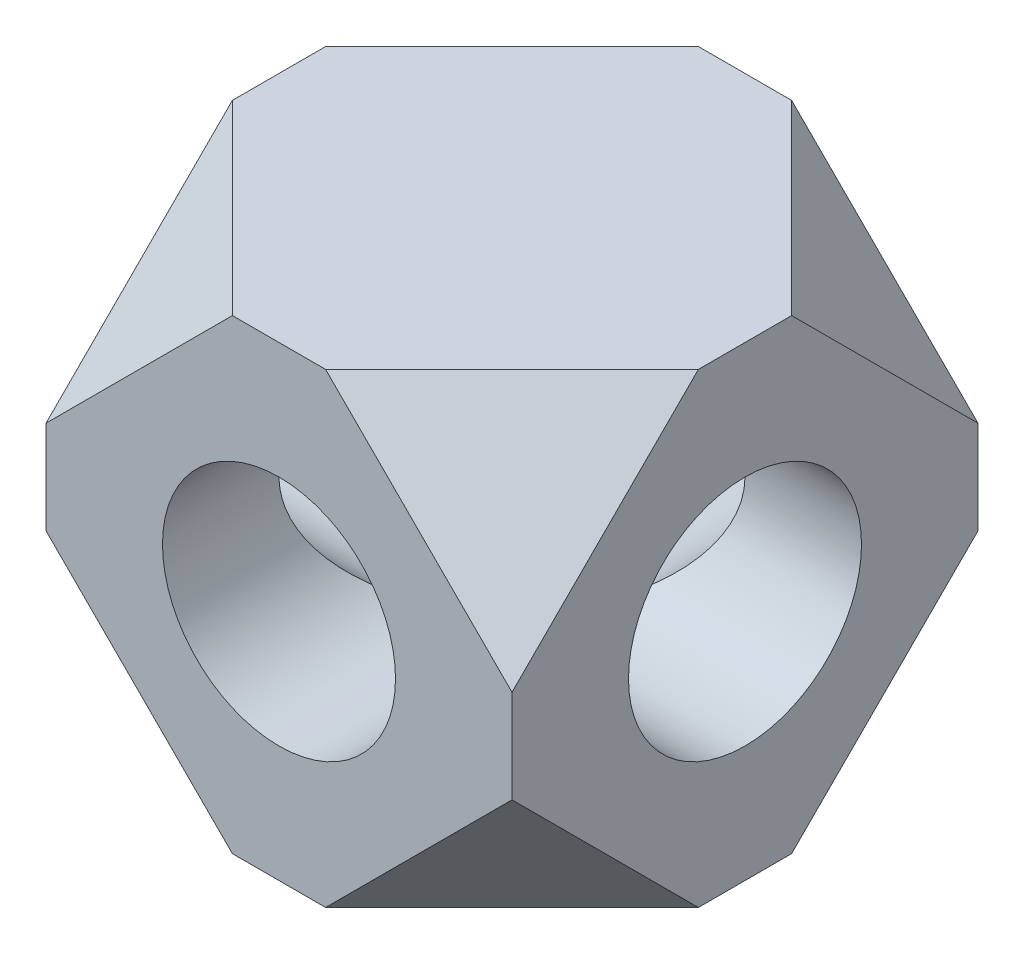
ISO-10303-21;
HEADER;
FILE_DESCRIPTION(('STEP AP214'),'2;1');
FILE_NAME('part.step','',(''),(''),'','','');
FILE_SCHEMA(('AUTOMOTIVE_DESIGN { 1 0 10303 214 1 1 1 1 }'));
ENDSEC;
DATA;
#1=APPLICATION_CONTEXT('core data for automotive mechanical design processes');
#2=APPLICATION_PROTOCOL_DEFINITION('international standard','automotive_design',2000,#1);
#3=PRODUCT_CONTEXT('',#1,'mechanical');
#4=PRODUCT('Part','Part','',(#3));
#5=PRODUCT_RELATED_PRODUCT_CATEGORY('part','',(#4));
#6=PRODUCT_DEFINITION_FORMATION('','',#4);
#7=PRODUCT_DEFINITION_CONTEXT('part definition',#1,'design');
#8=PRODUCT_DEFINITION('design','',#6,#7);
#9=PRODUCT_DEFINITION_SHAPE('','',#8);
#10=(LENGTH_UNIT() NAMED_UNIT(*) SI_UNIT(.MILLI.,.METRE.));
#11=(NAMED_UNIT(*) PLANE_ANGLE_UNIT() SI_UNIT($,.RADIAN.));
#12=(NAMED_UNIT(*) SI_UNIT($,.STERADIAN.) SOLID_ANGLE_UNIT());
#13=UNCERTAINTY_MEASURE_WITH_UNIT(LENGTH_MEASURE(1.E-05),#10,'distance_accuracy_value','');
#14=(GEOMETRIC_REPRESENTATION_CONTEXT(3) GLOBAL_UNCERTAINTY_ASSIGNED_CONTEXT((#13)) GLOBAL_UNIT_ASSIGNED_CONTEXT((#10,
#11,#12)) REPRESENTATION_CONTEXT('',''));
#15=CARTESIAN_POINT('',(0.,0.,0.));
#16=DIRECTION('',(0.,0.,1.));
#17=DIRECTION('',(1.,0.,0.));
#18=AXIS2_PLACEMENT_3D('',#15,#16,#17);
#19=CARTESIAN_POINT('',(9.52499999999997,9.52500000000031,9.52500000000006));
#20=DIRECTION('',(0.999999999999997,0.,0.));
#21=DIRECTION('',(0.,1.,0.));
#22=AXIS2_PLACEMENT_3D('',#19,#20,#21);
#23=PLANE('',#22);
#24=CARTESIAN_POINT('',(9.525,2.35922392732846E-13,0.));
#25=DIRECTION('',(0.999999999999997,0.,0.));
#26=DIRECTION('',(0.,0.,-1.));
#27=AXIS2_PLACEMENT_3D('',#24,#25,#26);
#28=CIRCLE('',#27,4.7625);
#29=CARTESIAN_POINT('',(9.52499999999998,2.31560257080154E-13,-4.76250000000001));
#30=VERTEX_POINT('',#29);
#31=EDGE_CURVE('E241',#30,#30,#28,.T.);
#32=ORIENTED_EDGE('',*,*,#31,.F.);
#33=EDGE_LOOP('',(#32));
#34=FACE_BOUND('',#33,.T.);
#35=DIRECTION('',(0.,-1.,0.));
#36=VECTOR('',#35,1.);
#37=CARTESIAN_POINT('',(9.52499999999997,9.52500000000031,9.52500000000006));
#38=LINE('',#37,#36);
#39=CARTESIAN_POINT('',(9.52499999999997,1.90500000000036,9.52500000000006));
#40=VERTEX_POINT('',#39);
#41=CARTESIAN_POINT('',(9.52500000000001,-1.90499999999991,9.525));
#42=VERTEX_POINT('',#41);
#43=EDGE_CURVE('E140',#40,#42,#38,.T.);
#44=ORIENTED_EDGE('',*,*,#43,.T.);
#45=DIRECTION('',(0.,-0.707106781186548,-0.707106781186547));
#46=VECTOR('',#45,1.);
#47=CARTESIAN_POINT('',(9.52499999999994,3.81000000000023,15.2400000000002));
#48=LINE('',#47,#46);
#49=CARTESIAN_POINT('',(9.52500000000004,-9.5249999999997,1.90500000000015));
#50=VERTEX_POINT('',#49);
#51=EDGE_CURVE('E139',#42,#50,#48,.T.);
#52=ORIENTED_EDGE('',*,*,#51,.T.);
#53=DIRECTION('',(0.,0.,-1.));
#54=VECTOR('',#53,1.);
#55=CARTESIAN_POINT('',(9.52500000000006,-9.52499999999981,9.52500000000003));
#56=LINE('',#55,#54);
#57=CARTESIAN_POINT('',(9.52500000000004,-9.52499999999976,-1.90500000000011));
#58=VERTEX_POINT('',#57);
#59=EDGE_CURVE('E128',#50,#58,#56,.T.);
#60=ORIENTED_EDGE('',*,*,#59,.T.);
#61=DIRECTION('',(0.,0.707106781186551,-0.707106781186544));
#62=VECTOR('',#61,1.);
#63=CARTESIAN_POINT('',(9.52499999999996,-5.71499999999974,-5.71500000000013));
#64=LINE('',#63,#62);
#65=CARTESIAN_POINT('',(9.52499999999999,-1.90499999999983,-9.52500000000001));
#66=VERTEX_POINT('',#65);
#67=EDGE_CURVE('E154',#58,#66,#64,.T.);
#68=ORIENTED_EDGE('',*,*,#67,.T.);
#69=DIRECTION('',(0.,-1.,0.));
#70=VECTOR('',#69,1.);
#71=CARTESIAN_POINT('',(9.52499999999997,9.52500000000021,-9.525));
#72=LINE('',#71,#70);
#73=CARTESIAN_POINT('',(9.525,1.90500000000012,-9.52500000000005));
#74=VERTEX_POINT('',#73);
#75=EDGE_CURVE('E221',#74,#66,#72,.T.);
#76=ORIENTED_EDGE('',*,*,#75,.F.);
#77=DIRECTION('',(0.,0.707106781186547,0.707106781186548));
#78=VECTOR('',#77,1.);
#79=CARTESIAN_POINT('',(9.525,15.2400000000003,3.81000000000009));
#80=LINE('',#79,#78);
#81=CARTESIAN_POINT('',(9.52499999999995,9.52500000000032,-1.90499999999994));
#82=VERTEX_POINT('',#81);
#83=EDGE_CURVE('E181',#74,#82,#80,.T.);
#84=ORIENTED_EDGE('',*,*,#83,.T.);
#85=DIRECTION('',(0.,0.,-1.));
#86=VECTOR('',#85,1.);
#87=CARTESIAN_POINT('',(9.52499999999997,9.52500000000031,9.52500000000006));
#88=LINE('',#87,#86);
#89=CARTESIAN_POINT('',(9.52499999999995,9.52500000000031,1.90500000000004));
#90=VERTEX_POINT('',#89);
#91=EDGE_CURVE('E136',#90,#82,#88,.T.);
#92=ORIENTED_EDGE('',*,*,#91,.F.);
#93=DIRECTION('',(0.,-0.707106781186544,0.707106781186551));
#94=VECTOR('',#93,1.);
#95=CARTESIAN_POINT('',(9.52499999999997,5.71500000000029,5.71500000000008));
#96=LINE('',#95,#94);
#97=EDGE_CURVE('E187',#90,#40,#96,.T.);
#98=ORIENTED_EDGE('',*,*,#97,.T.);
#99=EDGE_LOOP('',(#44,#52,#60,#68,#76,#84,#92,#98));
#100=FACE_BOUND('',#99,.T.);
#101=ADVANCED_FACE('F37',(#34,#100),#23,.T.);
#102=CARTESIAN_POINT('',(-9.52499999999987,-9.52499999999976,9.525));
#103=DIRECTION('',(-0.999999999999997,0.,0.));
#104=DIRECTION('',(0.,-1.,0.));
#105=AXIS2_PLACEMENT_3D('',#102,#103,#104);
#106=PLANE('',#105);
#107=CARTESIAN_POINT('',(-9.52499999999991,2.08166817117217E-13,0.));
#108=DIRECTION('',(0.999999999999997,0.,0.));
#109=DIRECTION('',(0.,0.,-1.));
#110=AXIS2_PLACEMENT_3D('',#107,#108,#109);
#111=CIRCLE('',#110,4.7625);
#112=CARTESIAN_POINT('',(-9.52499999999992,2.03804681464526E-13,-4.76250000000006));
#113=VERTEX_POINT('',#112);
#114=EDGE_CURVE('E238',#113,#113,#111,.T.);
#115=ORIENTED_EDGE('',*,*,#114,.T.);
#116=EDGE_LOOP('',(#115));
#117=FACE_BOUND('',#116,.T.);
#118=DIRECTION('',(0.,0.,-1.));
#119=VECTOR('',#118,1.);
#120=CARTESIAN_POINT('',(-9.52499999999987,-9.52499999999976,9.525));
#121=LINE('',#120,#119);
#122=CARTESIAN_POINT('',(-9.52499999999988,-9.52499999999976,1.90500000000002));
#123=VERTEX_POINT('',#122);
#124=CARTESIAN_POINT('',(-9.52499999999989,-9.52499999999974,-1.90500000000005));
#125=VERTEX_POINT('',#124);
#126=EDGE_CURVE('E135',#123,#125,#121,.T.);
#127=ORIENTED_EDGE('',*,*,#126,.F.);
#128=DIRECTION('',(0.,0.707106781186547,0.707106781186548));
#129=VECTOR('',#128,1.);
#130=CARTESIAN_POINT('',(-9.52499999999985,-5.71499999999978,5.71500000000002));
#131=LINE('',#130,#129);
#132=CARTESIAN_POINT('',(-9.52499999999989,-1.90499999999977,9.525));
#133=VERTEX_POINT('',#132);
#134=EDGE_CURVE('E151',#123,#133,#131,.T.);
#135=ORIENTED_EDGE('',*,*,#134,.T.);
#136=DIRECTION('',(0.,1.,0.));
#137=VECTOR('',#136,1.);
#138=CARTESIAN_POINT('',(-9.52499999999987,-9.52499999999976,9.525));
#139=LINE('',#138,#137);
#140=CARTESIAN_POINT('',(-9.52499999999986,1.90500000000025,9.52500000000001));
#141=VERTEX_POINT('',#140);
#142=EDGE_CURVE('E220',#133,#141,#139,.T.);
#143=ORIENTED_EDGE('',*,*,#142,.T.);
#144=DIRECTION('',(0.,0.707106781186551,-0.707106781186544));
#145=VECTOR('',#144,1.);
#146=CARTESIAN_POINT('',(-9.52499999999986,-3.8099999999998,15.24));
#147=LINE('',#146,#145);
#148=CARTESIAN_POINT('',(-9.52499999999997,9.52500000000027,1.90499999999989));
#149=VERTEX_POINT('',#148);
#150=EDGE_CURVE('E195',#141,#149,#147,.T.);
#151=ORIENTED_EDGE('',*,*,#150,.T.);
#152=DIRECTION('',(0.,0.,-1.));
#153=VECTOR('',#152,1.);
#154=CARTESIAN_POINT('',(-9.52499999999986,9.52500000000026,9.52500000000001));
#155=LINE('',#154,#153);
#156=CARTESIAN_POINT('',(-9.52499999999988,9.52500000000026,-1.90500000000009));
#157=VERTEX_POINT('',#156);
#158=EDGE_CURVE('E212',#149,#157,#155,.T.);
#159=ORIENTED_EDGE('',*,*,#158,.T.);
#160=DIRECTION('',(0.,-0.707106781186548,-0.707106781186547));
#161=VECTOR('',#160,1.);
#162=CARTESIAN_POINT('',(-9.52499999999979,5.71500000000033,-5.71500000000013));
#163=LINE('',#162,#161);
#164=CARTESIAN_POINT('',(-9.52499999999986,1.90500000000042,-9.52500000000003));
#165=VERTEX_POINT('',#164);
#166=EDGE_CURVE('E170',#157,#165,#163,.T.);
#167=ORIENTED_EDGE('',*,*,#166,.T.);
#168=DIRECTION('',(0.,1.,0.));
#169=VECTOR('',#168,1.);
#170=CARTESIAN_POINT('',(-9.5249999999999,-9.52499999999977,-9.52500000000005));
#171=LINE('',#170,#169);
#172=CARTESIAN_POINT('',(-9.52499999999991,-1.90499999999976,-9.52500000000005));
#173=VERTEX_POINT('',#172);
#174=EDGE_CURVE('E226',#173,#165,#171,.T.);
#175=ORIENTED_EDGE('',*,*,#174,.F.);
#176=DIRECTION('',(0.,-0.707106781186544,0.707106781186551));
#177=VECTOR('',#176,1.);
#178=CARTESIAN_POINT('',(-9.52499999999987,-15.2399999999998,3.81000000000001));
#179=LINE('',#178,#177);
#180=EDGE_CURVE('E164',#173,#125,#179,.T.);
#181=ORIENTED_EDGE('',*,*,#180,.T.);
#182=EDGE_LOOP('',(#127,#135,#143,#151,#159,#167,#175,#181));
#183=FACE_BOUND('',#182,.T.);
#184=ADVANCED_FACE('F39',(#117,#183),#106,.T.);
#185=CARTESIAN_POINT('',(-9.5249999999999,-9.52499999999977,-9.52500000000005));
#186=DIRECTION('',(0.,0.,-1.));
#187=DIRECTION('',(-0.999999999999997,0.,0.));
#188=AXIS2_PLACEMENT_3D('',#185,#186,#187);
#189=PLANE('',#188);
#190=CARTESIAN_POINT('',(0.,1.2490009027033E-13,-9.52500000000004));
#191=DIRECTION('',(0.,0.,1.));
#192=DIRECTION('',(0.999999999999997,0.,0.));
#193=AXIS2_PLACEMENT_3D('',#190,#191,#192);
#194=CIRCLE('',#193,4.7625);
#195=CARTESIAN_POINT('',(4.76250000000003,1.10624009952431E-13,-9.52500000000003));
#196=VERTEX_POINT('',#195);
#197=EDGE_CURVE('E235',#196,#196,#194,.T.);
#198=ORIENTED_EDGE('',*,*,#197,.T.);
#199=EDGE_LOOP('',(#198));
#200=FACE_BOUND('',#199,.T.);
#201=ORIENTED_EDGE('',*,*,#75,.T.);
#202=DIRECTION('',(-0.707106781186546,-0.70710678118655,0.));
#203=VECTOR('',#202,1.);
#204=CARTESIAN_POINT('',(-3.80999999999992,-15.2399999999997,-9.52500000000005));
#205=LINE('',#204,#203);
#206=CARTESIAN_POINT('',(1.90500000000009,-9.52499999999971,-9.52500000000004));
#207=VERTEX_POINT('',#206);
#208=EDGE_CURVE('E156',#66,#207,#205,.T.);
#209=ORIENTED_EDGE('',*,*,#208,.T.);
#210=DIRECTION('',(0.999999999999997,0.,0.));
#211=VECTOR('',#210,1.);
#212=CARTESIAN_POINT('',(-9.5249999999999,-9.52499999999977,-9.52500000000005));
#213=LINE('',#212,#211);
#214=CARTESIAN_POINT('',(-1.90499999999997,-9.52499999999976,-9.52500000000004));
#215=VERTEX_POINT('',#214);
#216=EDGE_CURVE('E218',#215,#207,#213,.T.);
#217=ORIENTED_EDGE('',*,*,#216,.F.);
#218=DIRECTION('',(-0.707106781186548,0.707106781186547,0.));
#219=VECTOR('',#218,1.);
#220=CARTESIAN_POINT('',(-5.7149999999999,-5.71499999999977,-9.52500000000006));
#221=LINE('',#220,#219);
#222=EDGE_CURVE('E162',#215,#173,#221,.T.);
#223=ORIENTED_EDGE('',*,*,#222,.T.);
#224=ORIENTED_EDGE('',*,*,#174,.T.);
#225=DIRECTION('',(0.70710678118655,0.707106781186545,0.));
#226=VECTOR('',#225,1.);
#227=CARTESIAN_POINT('',(-15.2399999999999,-3.8099999999997,-9.52500000000004));
#228=LINE('',#227,#226);
#229=CARTESIAN_POINT('',(-1.90499999999989,9.5250000000003,-9.52500000000003));
#230=VERTEX_POINT('',#229);
#231=EDGE_CURVE('E173',#165,#230,#228,.T.);
#232=ORIENTED_EDGE('',*,*,#231,.T.);
#233=DIRECTION('',(-0.999999999999997,0.,0.));
#234=VECTOR('',#233,1.);
#235=CARTESIAN_POINT('',(9.52499999999997,9.52500000000021,-9.525));
#236=LINE('',#235,#234);
#237=CARTESIAN_POINT('',(1.9049999999999,9.52500000000027,-9.52500000000002));
#238=VERTEX_POINT('',#237);
#239=EDGE_CURVE('E224',#238,#230,#236,.T.);
#240=ORIENTED_EDGE('',*,*,#239,.F.);
#241=DIRECTION('',(0.707106781186547,-0.707106781186548,0.));
#242=VECTOR('',#241,1.);
#243=CARTESIAN_POINT('',(5.71500000000002,5.71500000000011,-9.52500000000009));
#244=LINE('',#243,#242);
#245=EDGE_CURVE('E179',#238,#74,#244,.T.);
#246=ORIENTED_EDGE('',*,*,#245,.T.);
#247=EDGE_LOOP('',(#201,#209,#217,#223,#224,#232,#240,#246));
#248=FACE_BOUND('',#247,.T.);
#249=ADVANCED_FACE('F272',(#200,#248),#189,.T.);
#250=CARTESIAN_POINT('',(0.,2.08166817117217E-13,9.525));
#251=DIRECTION('',(0.,0.,-1.));
#252=DIRECTION('',(-0.999999999999997,0.,0.));
#253=AXIS2_PLACEMENT_3D('',#250,#251,#252);
#254=CYLINDRICAL_SURFACE('',#253,4.7625);
#255=CARTESIAN_POINT('',(0.,2.08166817117217E-13,0.));
#256=DIRECTION('',(0.707106781186544,0.,-0.707106781186548));
#257=DIRECTION('',(-0.707106781186546,0.,-0.707106781186551));
#258=AXIS2_PLACEMENT_3D('',#255,#256,#257);
#259=ELLIPSE('',#258,6.73519209080187,4.7625);
#260=CARTESIAN_POINT('',(1.04083408558608E-13,-4.76249999999981,0.));
#261=VERTEX_POINT('',#260);
#262=CARTESIAN_POINT('',(0.,4.76250000000006,0.));
#263=VERTEX_POINT('',#262);
#264=EDGE_CURVE('E201',#261,#263,#259,.F.);
#265=ORIENTED_EDGE('',*,*,#264,.F.);
#266=CARTESIAN_POINT('',(0.,2.08166817117217E-13,0.));
#267=DIRECTION('',(-0.707106781186546,0.,-0.707106781186551));
#268=DIRECTION('',(0.707106781186544,0.,-0.707106781186548));
#269=AXIS2_PLACEMENT_3D('',#266,#267,#268);
#270=ELLIPSE('',#269,6.73519209080187,4.7625);
#271=EDGE_CURVE('E209',#263,#261,#270,.F.);
#272=ORIENTED_EDGE('',*,*,#271,.F.);
#273=EDGE_LOOP('',(#265,#272));
#274=FACE_BOUND('',#273,.T.);
#275=CARTESIAN_POINT('',(0.,2.08166817117217E-13,9.525));
#276=DIRECTION('',(0.,0.,1.));
#277=DIRECTION('',(0.999999999999997,0.,0.));
#278=AXIS2_PLACEMENT_3D('',#275,#276,#277);
#279=CIRCLE('',#278,4.7625);
#280=CARTESIAN_POINT('',(4.76250000000008,1.93890736799318E-13,9.52500000000001));
#281=VERTEX_POINT('',#280);
#282=EDGE_CURVE('E228',#281,#281,#279,.T.);
#283=ORIENTED_EDGE('',*,*,#282,.T.);
#284=EDGE_LOOP('',(#283));
#285=FACE_BOUND('',#284,.T.);
#286=ADVANCED_FACE('F264',(#274,#285),#254,.F.);
#287=CARTESIAN_POINT('',(-9.52499999999987,-9.52499999999976,9.525));
#288=DIRECTION('',(0.,0.,-1.));
#289=DIRECTION('',(-0.999999999999997,0.,0.));
#290=AXIS2_PLACEMENT_3D('',#287,#288,#289);
#291=PLANE('',#290);
#292=DIRECTION('',(-0.70710678118655,-0.707106781186546,0.));
#293=VECTOR('',#292,1.);
#294=CARTESIAN_POINT('',(-3.8099999999999,-15.2399999999998,9.52499999999999));
#295=LINE('',#294,#293);
#296=CARTESIAN_POINT('',(1.90500000000011,-9.52499999999976,9.52500000000002));
#297=VERTEX_POINT('',#296);
#298=EDGE_CURVE('E45',#42,#297,#295,.T.);
#299=ORIENTED_EDGE('',*,*,#298,.F.);
#300=ORIENTED_EDGE('',*,*,#43,.F.);
#301=DIRECTION('',(0.707106781186549,-0.707106781186547,0.));
#302=VECTOR('',#301,1.);
#303=CARTESIAN_POINT('',(5.71500000000013,5.71500000000028,9.52499999999995));
#304=LINE('',#303,#302);
#305=CARTESIAN_POINT('',(1.90500000000001,9.52500000000029,9.52500000000004));
#306=VERTEX_POINT('',#305);
#307=EDGE_CURVE('E189',#306,#40,#304,.T.);
#308=ORIENTED_EDGE('',*,*,#307,.F.);
#309=DIRECTION('',(-0.999999999999997,0.,0.));
#310=VECTOR('',#309,1.);
#311=CARTESIAN_POINT('',(9.52499999999997,9.52500000000031,9.52500000000006));
#312=LINE('',#311,#310);
#313=CARTESIAN_POINT('',(-1.9049999999998,9.52500000000031,9.52500000000004));
#314=VERTEX_POINT('',#313);
#315=EDGE_CURVE('E231',#306,#314,#312,.T.);
#316=ORIENTED_EDGE('',*,*,#315,.T.);
#317=DIRECTION('',(0.707106781186546,0.70710678118655,0.));
#318=VECTOR('',#317,1.);
#319=CARTESIAN_POINT('',(-15.2399999999999,-3.80999999999979,9.525));
#320=LINE('',#319,#318);
#321=EDGE_CURVE('E198',#141,#314,#320,.T.);
#322=ORIENTED_EDGE('',*,*,#321,.F.);
#323=ORIENTED_EDGE('',*,*,#142,.F.);
#324=DIRECTION('',(-0.707106781186547,0.707106781186548,0.));
#325=VECTOR('',#324,1.);
#326=CARTESIAN_POINT('',(-5.71499999999989,-5.71499999999978,9.52499999999998));
#327=LINE('',#326,#325);
#328=CARTESIAN_POINT('',(-1.9049999999999,-9.52499999999974,9.52500000000003));
#329=VERTEX_POINT('',#328);
#330=EDGE_CURVE('E148',#329,#133,#327,.T.);
#331=ORIENTED_EDGE('',*,*,#330,.F.);
#332=DIRECTION('',(0.999999999999997,0.,0.));
#333=VECTOR('',#332,1.);
#334=CARTESIAN_POINT('',(-9.52499999999987,-9.52499999999976,9.525));
#335=LINE('',#334,#333);
#336=EDGE_CURVE('E215',#329,#297,#335,.T.);
#337=ORIENTED_EDGE('',*,*,#336,.T.);
#338=EDGE_LOOP('',(#299,#300,#308,#316,#322,#323,#331,#337));
#339=FACE_BOUND('',#338,.T.);
#340=ORIENTED_EDGE('',*,*,#282,.F.);
#341=EDGE_LOOP('',(#340));
#342=FACE_BOUND('',#341,.T.);
#343=ADVANCED_FACE('F281',(#339,#342),#291,.F.);
#344=CARTESIAN_POINT('',(-9.52499999999987,-9.52499999999976,9.525));
#345=DIRECTION('',(0.,1.,0.));
#346=DIRECTION('',(-0.999999999999997,0.,0.));
#347=AXIS2_PLACEMENT_3D('',#344,#345,#346);
#348=PLANE('',#347);
#349=DIRECTION('',(0.70710678118655,0.,-0.707106781186545));
#350=VECTOR('',#349,1.);
#351=CARTESIAN_POINT('',(-3.80999999999991,-9.52499999999975,15.24));
#352=LINE('',#351,#350);
#353=EDGE_CURVE('E11',#297,#50,#352,.T.);
#354=ORIENTED_EDGE('',*,*,#353,.F.);
#355=ORIENTED_EDGE('',*,*,#336,.F.);
#356=DIRECTION('',(0.707106781186546,0.,0.707106781186548));
#357=VECTOR('',#356,1.);
#358=CARTESIAN_POINT('',(-5.71499999999989,-9.52499999999974,5.71500000000003));
#359=LINE('',#358,#357);
#360=EDGE_CURVE('E142',#123,#329,#359,.T.);
#361=ORIENTED_EDGE('',*,*,#360,.F.);
#362=ORIENTED_EDGE('',*,*,#126,.T.);
#363=DIRECTION('',(-0.707106781186545,0.,0.70710678118655));
#364=VECTOR('',#363,1.);
#365=CARTESIAN_POINT('',(-15.2399999999999,-9.52499999999976,3.81000000000001));
#366=LINE('',#365,#364);
#367=EDGE_CURVE('E159',#215,#125,#366,.T.);
#368=ORIENTED_EDGE('',*,*,#367,.F.);
#369=ORIENTED_EDGE('',*,*,#216,.T.);
#370=DIRECTION('',(-0.707106781186549,0.,-0.707106781186546));
#371=VECTOR('',#370,1.);
#372=CARTESIAN_POINT('',(5.7150000000001,-9.5249999999997,-5.71500000000003));
#373=LINE('',#372,#371);
#374=EDGE_CURVE('E132',#58,#207,#373,.T.);
#375=ORIENTED_EDGE('',*,*,#374,.F.);
#376=ORIENTED_EDGE('',*,*,#59,.F.);
#377=EDGE_LOOP('',(#354,#355,#361,#362,#368,#369,#375,#376));
#378=FACE_BOUND('',#377,.T.);
#379=ADVANCED_FACE('F130',(#378),#348,.F.);
#380=CARTESIAN_POINT('',(9.52499999999997,9.52500000000031,9.52500000000006));
#381=DIRECTION('',(0.,-1.,0.));
#382=DIRECTION('',(0.999999999999997,0.,0.));
#383=AXIS2_PLACEMENT_3D('',#380,#381,#382);
#384=PLANE('',#383);
#385=DIRECTION('',(0.70710678118655,0.,-0.707106781186545));
#386=VECTOR('',#385,1.);
#387=CARTESIAN_POINT('',(-5.71499999999996,9.52500000000028,-5.71499999999999));
#388=LINE('',#387,#386);
#389=EDGE_CURVE('E167',#157,#230,#388,.T.);
#390=ORIENTED_EDGE('',*,*,#389,.F.);
#391=ORIENTED_EDGE('',*,*,#158,.F.);
#392=DIRECTION('',(-0.707106781186549,0.,-0.707106781186546));
#393=VECTOR('',#392,1.);
#394=CARTESIAN_POINT('',(3.81000000000012,9.52500000000029,15.2399999999999));
#395=LINE('',#394,#393);
#396=EDGE_CURVE('E192',#314,#149,#395,.T.);
#397=ORIENTED_EDGE('',*,*,#396,.F.);
#398=ORIENTED_EDGE('',*,*,#315,.F.);
#399=DIRECTION('',(-0.707106781186545,0.,0.70710678118655));
#400=VECTOR('',#399,1.);
#401=CARTESIAN_POINT('',(5.71499999999995,9.5250000000003,5.71500000000008));
#402=LINE('',#401,#400);
#403=EDGE_CURVE('E184',#90,#306,#402,.T.);
#404=ORIENTED_EDGE('',*,*,#403,.F.);
#405=ORIENTED_EDGE('',*,*,#91,.T.);
#406=DIRECTION('',(0.707106781186546,0.,0.707106781186549));
#407=VECTOR('',#406,1.);
#408=CARTESIAN_POINT('',(15.24,9.52500000000033,3.81000000000009));
#409=LINE('',#408,#407);
#410=EDGE_CURVE('E176',#238,#82,#409,.T.);
#411=ORIENTED_EDGE('',*,*,#410,.F.);
#412=ORIENTED_EDGE('',*,*,#239,.T.);
#413=EDGE_LOOP('',(#390,#391,#397,#398,#404,#405,#411,#412));
#414=FACE_BOUND('',#413,.T.);
#415=ADVANCED_FACE('F261',(#414),#384,.F.);
#416=CARTESIAN_POINT('',(0.,2.08166817117217E-13,0.));
#417=DIRECTION('',(0.707106781186544,0.,-0.707106781186548));
#418=DIRECTION('',(-0.707106781186546,0.,-0.707106781186551));
#419=AXIS2_PLACEMENT_3D('',#416,#417,#418);
#420=ELLIPSE('',#419,6.73519209080187,4.7625);
#421=EDGE_CURVE('E204',#261,#263,#420,.T.);
#422=ORIENTED_EDGE('',*,*,#421,.F.);
#423=CARTESIAN_POINT('',(0.,2.08166817117217E-13,0.));
#424=DIRECTION('',(-0.707106781186546,0.,-0.707106781186551));
#425=DIRECTION('',(0.707106781186544,0.,-0.707106781186548));
#426=AXIS2_PLACEMENT_3D('',#423,#424,#425);
#427=ELLIPSE('',#426,6.73519209080187,4.7625);
#428=EDGE_CURVE('E207',#263,#261,#427,.T.);
#429=ORIENTED_EDGE('',*,*,#428,.F.);
#430=EDGE_LOOP('',(#422,#429));
#431=FACE_BOUND('',#430,.T.);
#432=ORIENTED_EDGE('',*,*,#197,.F.);
#433=EDGE_LOOP('',(#432));
#434=FACE_BOUND('',#433,.T.);
#435=ADVANCED_FACE('F252',(#431,#434),#254,.F.);
#436=CARTESIAN_POINT('',(-9.52499999999991,2.08166817117217E-13,0.));
#437=DIRECTION('',(0.999999999999997,0.,0.));
#438=DIRECTION('',(0.,0.,-1.));
#439=AXIS2_PLACEMENT_3D('',#436,#437,#438);
#440=CYLINDRICAL_SURFACE('',#439,4.7625);
#441=ORIENTED_EDGE('',*,*,#421,.T.);
#442=ORIENTED_EDGE('',*,*,#271,.T.);
#443=EDGE_LOOP('',(#441,#442));
#444=FACE_BOUND('',#443,.T.);
#445=ORIENTED_EDGE('',*,*,#114,.F.);
#446=EDGE_LOOP('',(#445));
#447=FACE_BOUND('',#446,.T.);
#448=ADVANCED_FACE('F249',(#444,#447),#440,.F.);
#449=ORIENTED_EDGE('',*,*,#264,.T.);
#450=ORIENTED_EDGE('',*,*,#428,.T.);
#451=EDGE_LOOP('',(#449,#450));
#452=FACE_BOUND('',#451,.T.);
#453=ORIENTED_EDGE('',*,*,#31,.T.);
#454=EDGE_LOOP('',(#453));
#455=FACE_BOUND('',#454,.T.);
#456=ADVANCED_FACE('F251',(#452,#455),#440,.F.);
#457=CARTESIAN_POINT('',(-6.98500000000004,6.98500000000002,6.98500000000005));
#458=DIRECTION('',(-0.577350269189626,0.577350269189624,0.577350269189627));
#459=DIRECTION('',(0.707106781186548,0.,0.707106781186547));
#460=AXIS2_PLACEMENT_3D('',#457,#458,#459);
#461=PLANE('',#460);
#462=ORIENTED_EDGE('',*,*,#150,.F.);
#463=ORIENTED_EDGE('',*,*,#321,.T.);
#464=ORIENTED_EDGE('',*,*,#396,.T.);
#465=EDGE_LOOP('',(#462,#463,#464));
#466=FACE_BOUND('',#465,.T.);
#467=ADVANCED_FACE('F259',(#466),#461,.T.);
#468=CARTESIAN_POINT('',(6.98500000000012,6.98500000000013,6.98500000000009));
#469=DIRECTION('',(0.577350269189626,0.577350269189627,0.577350269189624));
#470=DIRECTION('',(-0.707106781186548,0.707106781186547,0.));
#471=AXIS2_PLACEMENT_3D('',#468,#469,#470);
#472=PLANE('',#471);
#473=ORIENTED_EDGE('',*,*,#403,.T.);
#474=ORIENTED_EDGE('',*,*,#307,.T.);
#475=ORIENTED_EDGE('',*,*,#97,.F.);
#476=EDGE_LOOP('',(#473,#474,#475));
#477=FACE_BOUND('',#476,.T.);
#478=ADVANCED_FACE('F308',(#477),#472,.T.);
#479=CARTESIAN_POINT('',(6.98500000000008,6.98500000000007,-6.98500000000007));
#480=DIRECTION('',(0.577350269189626,0.577350269189626,-0.577350269189625));
#481=DIRECTION('',(-0.707106781186547,0.707106781186548,0.));
#482=AXIS2_PLACEMENT_3D('',#479,#480,#481);
#483=PLANE('',#482);
#484=ORIENTED_EDGE('',*,*,#83,.F.);
#485=ORIENTED_EDGE('',*,*,#245,.F.);
#486=ORIENTED_EDGE('',*,*,#410,.T.);
#487=EDGE_LOOP('',(#484,#485,#486));
#488=FACE_BOUND('',#487,.T.);
#489=ADVANCED_FACE('F305',(#488),#483,.T.);
#490=CARTESIAN_POINT('',(-6.98500000000006,6.98500000000008,-6.98500000000009));
#491=DIRECTION('',(-0.577350269189624,0.577350269189626,-0.577350269189627));
#492=DIRECTION('',(0.,0.707106781186548,0.707106781186547));
#493=AXIS2_PLACEMENT_3D('',#490,#491,#492);
#494=PLANE('',#493);
#495=ORIENTED_EDGE('',*,*,#231,.F.);
#496=ORIENTED_EDGE('',*,*,#166,.F.);
#497=ORIENTED_EDGE('',*,*,#389,.T.);
#498=EDGE_LOOP('',(#495,#496,#497));
#499=FACE_BOUND('',#498,.T.);
#500=ADVANCED_FACE('F290',(#499),#494,.T.);
#501=CARTESIAN_POINT('',(-6.98499999999991,-6.98499999999992,-6.98499999999988));
#502=DIRECTION('',(-0.577350269189627,-0.577350269189627,-0.577350269189624));
#503=DIRECTION('',(0.707106781186548,-0.707106781186547,0.));
#504=AXIS2_PLACEMENT_3D('',#501,#502,#503);
#505=PLANE('',#504);
#506=ORIENTED_EDGE('',*,*,#180,.F.);
#507=ORIENTED_EDGE('',*,*,#222,.F.);
#508=ORIENTED_EDGE('',*,*,#367,.T.);
#509=EDGE_LOOP('',(#506,#507,#508));
#510=FACE_BOUND('',#509,.T.);
#511=ADVANCED_FACE('F297',(#510),#505,.T.);
#512=CARTESIAN_POINT('',(6.98499999999994,-6.98499999999993,-6.98499999999996));
#513=DIRECTION('',(0.577350269189626,-0.577350269189624,-0.577350269189627));
#514=DIRECTION('',(-0.707106781186548,0.,-0.707106781186547));
#515=AXIS2_PLACEMENT_3D('',#512,#513,#514);
#516=PLANE('',#515);
#517=ORIENTED_EDGE('',*,*,#208,.F.);
#518=ORIENTED_EDGE('',*,*,#67,.F.);
#519=ORIENTED_EDGE('',*,*,#374,.T.);
#520=EDGE_LOOP('',(#517,#518,#519));
#521=FACE_BOUND('',#520,.T.);
#522=ADVANCED_FACE('F301',(#521),#516,.T.);
#523=CARTESIAN_POINT('',(-6.98499999999989,-6.98499999999988,6.98499999999988));
#524=DIRECTION('',(-0.577350269189626,-0.577350269189626,0.577350269189626));
#525=DIRECTION('',(0.707106781186547,0.,0.707106781186548));
#526=AXIS2_PLACEMENT_3D('',#523,#524,#525);
#527=PLANE('',#526);
#528=ORIENTED_EDGE('',*,*,#134,.F.);
#529=ORIENTED_EDGE('',*,*,#360,.T.);
#530=ORIENTED_EDGE('',*,*,#330,.T.);
#531=EDGE_LOOP('',(#528,#529,#530));
#532=FACE_BOUND('',#531,.T.);
#533=ADVANCED_FACE('F328',(#532),#527,.T.);
#534=CARTESIAN_POINT('',(6.98499999999994,-6.98499999999996,6.98499999999997));
#535=DIRECTION('',(0.577350269189624,-0.577350269189626,0.577350269189627));
#536=DIRECTION('',(0.,-0.707106781186548,-0.707106781186547));
#537=AXIS2_PLACEMENT_3D('',#534,#535,#536);
#538=PLANE('',#537);
#539=ORIENTED_EDGE('',*,*,#51,.F.);
#540=ORIENTED_EDGE('',*,*,#298,.T.);
#541=ORIENTED_EDGE('',*,*,#353,.T.);
#542=EDGE_LOOP('',(#539,#540,#541));
#543=FACE_BOUND('',#542,.T.);
#544=ADVANCED_FACE('F144',(#543),#538,.T.);
#545=CLOSED_SHELL('',(#101,#184,#249,#286,#343,#379,#415,#435,#448,#456,#467,#478,#489,#500,
#511,#522,#533,#544));
#546=MANIFOLD_SOLID_BREP('B2',#545);
#547=ADVANCED_BREP_SHAPE_REPRESENTATION('',(#18,#546),#14);
#548=SHAPE_DEFINITION_REPRESENTATION(#9,#547);
ENDSEC;
END-ISO-10303-21;
